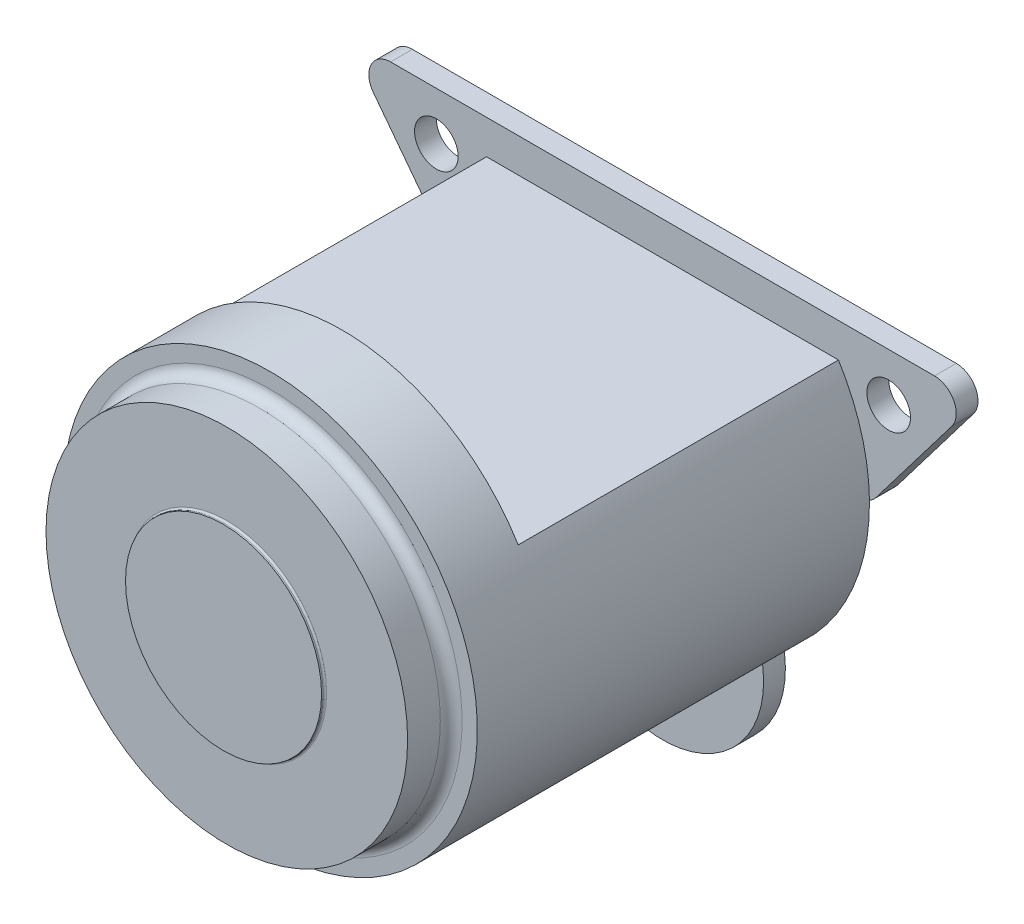
ISO-10303-21;
HEADER;
FILE_DESCRIPTION(('STEP AP214'),'2;1');
FILE_NAME('part.step','',(''),(''),'','','');
FILE_SCHEMA(('AUTOMOTIVE_DESIGN { 1 0 10303 214 1 1 1 1 }'));
ENDSEC;
DATA;
#1=APPLICATION_CONTEXT('core data for automotive mechanical design processes');
#2=APPLICATION_PROTOCOL_DEFINITION('international standard','automotive_design',2000,#1);
#3=PRODUCT_CONTEXT('',#1,'mechanical');
#4=PRODUCT('Part','Part','',(#3));
#5=PRODUCT_RELATED_PRODUCT_CATEGORY('part','',(#4));
#6=PRODUCT_DEFINITION_FORMATION('','',#4);
#7=PRODUCT_DEFINITION_CONTEXT('part definition',#1,'design');
#8=PRODUCT_DEFINITION('design','',#6,#7);
#9=PRODUCT_DEFINITION_SHAPE('','',#8);
#10=(LENGTH_UNIT() NAMED_UNIT(*) SI_UNIT(.MILLI.,.METRE.));
#11=(NAMED_UNIT(*) PLANE_ANGLE_UNIT() SI_UNIT($,.RADIAN.));
#12=(NAMED_UNIT(*) SI_UNIT($,.STERADIAN.) SOLID_ANGLE_UNIT());
#13=UNCERTAINTY_MEASURE_WITH_UNIT(LENGTH_MEASURE(1.E-05),#10,'distance_accuracy_value','');
#14=(GEOMETRIC_REPRESENTATION_CONTEXT(3) GLOBAL_UNCERTAINTY_ASSIGNED_CONTEXT((#13)) GLOBAL_UNIT_ASSIGNED_CONTEXT((#10,
#11,#12)) REPRESENTATION_CONTEXT('',''));
#15=CARTESIAN_POINT('',(0.,0.,0.));
#16=DIRECTION('',(0.,0.,1.));
#17=DIRECTION('',(1.,0.,0.));
#18=AXIS2_PLACEMENT_3D('',#15,#16,#17);
#19=CARTESIAN_POINT('',(0.,0.,0.));
#20=DIRECTION('',(0.,0.,1.));
#21=DIRECTION('',(1.,0.,0.));
#22=AXIS2_PLACEMENT_3D('',#19,#20,#21);
#23=CYLINDRICAL_SURFACE('',#22,95.);
#24=CARTESIAN_POINT('',(0.,0.,180.));
#25=DIRECTION('',(0.,0.,-1.));
#26=DIRECTION('',(1.,0.,0.));
#27=AXIS2_PLACEMENT_3D('',#24,#25,#26);
#28=CIRCLE('',#27,95.);
#29=CARTESIAN_POINT('',(-95.,0.,180.));
#30=VERTEX_POINT('',#29);
#31=EDGE_CURVE('E254',#30,#30,#28,.T.);
#32=ORIENTED_EDGE('',*,*,#31,.T.);
#33=DIRECTION('',(0.,0.,-1.));
#34=VECTOR('',#33,1.);
#35=CARTESIAN_POINT('',(-95.,0.,0.));
#36=LINE('',#35,#34);
#37=CARTESIAN_POINT('',(-95.,0.,0.));
#38=VERTEX_POINT('',#37);
#39=EDGE_CURVE('E11',#30,#38,#36,.T.);
#40=ORIENTED_EDGE('',*,*,#39,.T.);
#41=CARTESIAN_POINT('',(0.,0.,0.));
#42=DIRECTION('',(0.,0.,1.));
#43=DIRECTION('',(1.,0.,0.));
#44=AXIS2_PLACEMENT_3D('',#41,#42,#43);
#45=CIRCLE('',#44,95.);
#46=CARTESIAN_POINT('',(-45.,-83.6660026534075,0.));
#47=VERTEX_POINT('',#46);
#48=EDGE_CURVE('E406',#38,#47,#45,.T.);
#49=ORIENTED_EDGE('',*,*,#48,.T.);
#50=CARTESIAN_POINT('',(0.,0.,0.));
#51=DIRECTION('',(0.,0.,1.));
#52=DIRECTION('',(1.,0.,0.));
#53=AXIS2_PLACEMENT_3D('',#50,#51,#52);
#54=CIRCLE('',#53,95.);
#55=CARTESIAN_POINT('',(45.,-83.6660026534075,0.));
#56=VERTEX_POINT('',#55);
#57=EDGE_CURVE('E359',#47,#56,#54,.T.);
#58=ORIENTED_EDGE('',*,*,#57,.T.);
#59=CARTESIAN_POINT('',(0.,0.,0.));
#60=DIRECTION('',(0.,0.,1.));
#61=DIRECTION('',(1.,0.,0.));
#62=AXIS2_PLACEMENT_3D('',#59,#60,#61);
#63=CIRCLE('',#62,95.);
#64=CARTESIAN_POINT('',(94.9909756892941,1.30940352677538,0.));
#65=VERTEX_POINT('',#64);
#66=EDGE_CURVE('E300',#56,#65,#63,.T.);
#67=ORIENTED_EDGE('',*,*,#66,.T.);
#68=CARTESIAN_POINT('',(0.,0.,0.));
#69=DIRECTION('',(0.,0.,1.));
#70=DIRECTION('',(1.,0.,0.));
#71=AXIS2_PLACEMENT_3D('',#68,#69,#70);
#72=CIRCLE('',#71,95.);
#73=CARTESIAN_POINT('',(80.7774721070176,50.,0.));
#74=VERTEX_POINT('',#73);
#75=EDGE_CURVE('E336',#65,#74,#72,.T.);
#76=ORIENTED_EDGE('',*,*,#75,.T.);
#77=DIRECTION('',(0.,0.,1.));
#78=VECTOR('',#77,1.);
#79=CARTESIAN_POINT('',(80.7774721070176,50.,0.));
#80=LINE('',#79,#78);
#81=CARTESIAN_POINT('',(80.7774721070176,50.,147.));
#82=VERTEX_POINT('',#81);
#83=EDGE_CURVE('E409',#74,#82,#80,.T.);
#84=ORIENTED_EDGE('',*,*,#83,.T.);
#85=CARTESIAN_POINT('',(0.,0.,147.));
#86=DIRECTION('',(0.,0.,1.));
#87=DIRECTION('',(1.,0.,0.));
#88=AXIS2_PLACEMENT_3D('',#85,#86,#87);
#89=CIRCLE('',#88,95.);
#90=CARTESIAN_POINT('',(-80.7774721070175,50.,147.));
#91=VERTEX_POINT('',#90);
#92=EDGE_CURVE('E273',#82,#91,#89,.T.);
#93=ORIENTED_EDGE('',*,*,#92,.T.);
#94=DIRECTION('',(0.,0.,-1.));
#95=VECTOR('',#94,1.);
#96=CARTESIAN_POINT('',(-80.7774721070176,50.,0.));
#97=LINE('',#96,#95);
#98=CARTESIAN_POINT('',(-80.7774721070175,50.,0.));
#99=VERTEX_POINT('',#98);
#100=EDGE_CURVE('E358',#91,#99,#97,.T.);
#101=ORIENTED_EDGE('',*,*,#100,.T.);
#102=CARTESIAN_POINT('',(0.,0.,0.));
#103=DIRECTION('',(0.,0.,1.));
#104=DIRECTION('',(1.,0.,0.));
#105=AXIS2_PLACEMENT_3D('',#102,#103,#104);
#106=CIRCLE('',#105,95.);
#107=CARTESIAN_POINT('',(-94.9909756892941,1.30940352677539,0.));
#108=VERTEX_POINT('',#107);
#109=EDGE_CURVE('E325',#99,#108,#106,.T.);
#110=ORIENTED_EDGE('',*,*,#109,.T.);
#111=CARTESIAN_POINT('',(0.,0.,0.));
#112=DIRECTION('',(0.,0.,1.));
#113=DIRECTION('',(1.,0.,0.));
#114=AXIS2_PLACEMENT_3D('',#111,#112,#113);
#115=CIRCLE('',#114,95.);
#116=EDGE_CURVE('E413',#108,#38,#115,.T.);
#117=ORIENTED_EDGE('',*,*,#116,.T.);
#118=ORIENTED_EDGE('',*,*,#39,.F.);
#119=EDGE_LOOP('',(#32,#40,#49,#58,#67,#76,#84,#93,#101,#110,#117,#118));
#120=FACE_BOUND('',#119,.T.);
#121=ADVANCED_FACE('F16',(#120),#23,.T.);
#122=CARTESIAN_POINT('',(0.,0.,201.5));
#123=DIRECTION('',(0.,0.,1.));
#124=DIRECTION('',(1.,0.,0.));
#125=AXIS2_PLACEMENT_3D('',#122,#123,#124);
#126=PLANE('',#125);
#127=CARTESIAN_POINT('',(0.,0.,201.5));
#128=DIRECTION('',(0.,0.,1.));
#129=DIRECTION('',(1.,0.,0.));
#130=AXIS2_PLACEMENT_3D('',#127,#128,#129);
#131=CIRCLE('',#130,45.);
#132=CARTESIAN_POINT('',(-45.,0.,201.5));
#133=VERTEX_POINT('',#132);
#134=EDGE_CURVE('E434',#133,#133,#131,.T.);
#135=ORIENTED_EDGE('',*,*,#134,.T.);
#136=EDGE_LOOP('',(#135));
#137=FACE_BOUND('',#136,.T.);
#138=ADVANCED_FACE('F448',(#137),#126,.T.);
#139=CARTESIAN_POINT('',(0.,0.,200.));
#140=DIRECTION('',(0.,0.,1.));
#141=DIRECTION('',(1.,0.,0.));
#142=AXIS2_PLACEMENT_3D('',#139,#140,#141);
#143=PLANE('',#142);
#144=CARTESIAN_POINT('',(0.,0.,200.));
#145=DIRECTION('',(0.,0.,1.));
#146=DIRECTION('',(-1.,0.,0.));
#147=AXIS2_PLACEMENT_3D('',#144,#145,#146);
#148=CIRCLE('',#147,45.8);
#149=CARTESIAN_POINT('',(45.8,0.,200.));
#150=VERTEX_POINT('',#149);
#151=EDGE_CURVE('E45',#150,#150,#148,.T.);
#152=ORIENTED_EDGE('',*,*,#151,.F.);
#153=EDGE_LOOP('',(#152));
#154=FACE_BOUND('',#153,.T.);
#155=CARTESIAN_POINT('',(0.,0.,200.));
#156=DIRECTION('',(0.,0.,1.));
#157=DIRECTION('',(-1.,0.,0.));
#158=AXIS2_PLACEMENT_3D('',#155,#156,#157);
#159=CIRCLE('',#158,83.);
#160=CARTESIAN_POINT('',(83.,0.,200.));
#161=VERTEX_POINT('',#160);
#162=EDGE_CURVE('E235',#161,#161,#159,.T.);
#163=ORIENTED_EDGE('',*,*,#162,.T.);
#164=EDGE_LOOP('',(#163));
#165=FACE_BOUND('',#164,.T.);
#166=ADVANCED_FACE('F463',(#154,#165),#143,.T.);
#167=CARTESIAN_POINT('',(0.,0.,200.));
#168=DIRECTION('',(0.,0.,1.));
#169=DIRECTION('',(1.,0.,0.));
#170=AXIS2_PLACEMENT_3D('',#167,#168,#169);
#171=CYLINDRICAL_SURFACE('',#170,45.);
#172=ORIENTED_EDGE('',*,*,#134,.F.);
#173=DIRECTION('',(0.,0.,-1.));
#174=VECTOR('',#173,1.);
#175=CARTESIAN_POINT('',(-45.,0.,200.));
#176=LINE('',#175,#174);
#177=CARTESIAN_POINT('',(-45.,0.,200.8));
#178=VERTEX_POINT('',#177);
#179=EDGE_CURVE('E24',#133,#178,#176,.T.);
#180=ORIENTED_EDGE('',*,*,#179,.T.);
#181=CARTESIAN_POINT('',(0.,0.,200.8));
#182=DIRECTION('',(0.,0.,-1.));
#183=DIRECTION('',(-1.,0.,0.));
#184=AXIS2_PLACEMENT_3D('',#181,#182,#183);
#185=CIRCLE('',#184,45.);
#186=CARTESIAN_POINT('',(45.,0.,200.8));
#187=VERTEX_POINT('',#186);
#188=EDGE_CURVE('E268',#187,#178,#185,.T.);
#189=ORIENTED_EDGE('',*,*,#188,.F.);
#190=CARTESIAN_POINT('',(0.,0.,200.8));
#191=DIRECTION('',(0.,0.,-1.));
#192=DIRECTION('',(-1.,0.,0.));
#193=AXIS2_PLACEMENT_3D('',#190,#191,#192);
#194=CIRCLE('',#193,45.);
#195=EDGE_CURVE('E272',#178,#187,#194,.T.);
#196=ORIENTED_EDGE('',*,*,#195,.F.);
#197=ORIENTED_EDGE('',*,*,#179,.F.);
#198=EDGE_LOOP('',(#172,#180,#189,#196,#197));
#199=FACE_BOUND('',#198,.T.);
#200=ADVANCED_FACE('F449',(#199),#171,.T.);
#201=CARTESIAN_POINT('',(0.,0.,200.8));
#202=DIRECTION('',(0.,0.,-1.));
#203=DIRECTION('',(-1.,0.,0.));
#204=AXIS2_PLACEMENT_3D('',#201,#202,#203);
#205=TOROIDAL_SURFACE('',#204,45.8,0.8);
#206=ORIENTED_EDGE('',*,*,#188,.T.);
#207=ORIENTED_EDGE('',*,*,#195,.T.);
#208=CARTESIAN_POINT('',(45.8,0.,200.8));
#209=DIRECTION('',(0.,-1.,0.));
#210=DIRECTION('',(1.,0.,0.));
#211=AXIS2_PLACEMENT_3D('',#208,#209,#210);
#212=CIRCLE('',#211,0.8);
#213=EDGE_CURVE('E441',#187,#150,#212,.T.);
#214=ORIENTED_EDGE('',*,*,#213,.T.);
#215=ORIENTED_EDGE('',*,*,#151,.T.);
#216=ORIENTED_EDGE('',*,*,#213,.F.);
#217=EDGE_LOOP('',(#206,#207,#214,#215,#216));
#218=FACE_BOUND('',#217,.T.);
#219=ADVANCED_FACE('F451',(#218),#205,.F.);
#220=CARTESIAN_POINT('',(0.,72.5,147.));
#221=DIRECTION('',(0.,0.,-1.));
#222=DIRECTION('',(0.,-1.,0.));
#223=AXIS2_PLACEMENT_3D('',#220,#221,#222);
#224=PLANE('',#223);
#225=ORIENTED_EDGE('',*,*,#92,.F.);
#226=DIRECTION('',(1.,0.,0.));
#227=VECTOR('',#226,1.);
#228=CARTESIAN_POINT('',(80.7774721070176,50.,147.));
#229=LINE('',#228,#227);
#230=EDGE_CURVE('E428',#91,#82,#229,.T.);
#231=ORIENTED_EDGE('',*,*,#230,.F.);
#232=EDGE_LOOP('',(#225,#231));
#233=FACE_BOUND('',#232,.T.);
#234=ADVANCED_FACE('F453',(#233),#224,.T.);
#235=CARTESIAN_POINT('',(-80.7774721070175,50.,0.));
#236=DIRECTION('',(0.,-1.,0.));
#237=DIRECTION('',(-1.,0.,0.));
#238=AXIS2_PLACEMENT_3D('',#235,#236,#237);
#239=PLANE('',#238);
#240=DIRECTION('',(1.,0.,0.));
#241=VECTOR('',#240,1.);
#242=CARTESIAN_POINT('',(-40.3887360535088,50.,0.));
#243=LINE('',#242,#241);
#244=EDGE_CURVE('E332',#99,#74,#243,.T.);
#245=ORIENTED_EDGE('',*,*,#244,.F.);
#246=ORIENTED_EDGE('',*,*,#100,.F.);
#247=ORIENTED_EDGE('',*,*,#230,.T.);
#248=ORIENTED_EDGE('',*,*,#83,.F.);
#249=EDGE_LOOP('',(#245,#246,#247,#248));
#250=FACE_BOUND('',#249,.T.);
#251=ADVANCED_FACE('F460',(#250),#239,.F.);
#252=CARTESIAN_POINT('',(0.,32.849205670201,-10.));
#253=DIRECTION('',(0.,0.,-1.));
#254=DIRECTION('',(0.,-1.,0.));
#255=AXIS2_PLACEMENT_3D('',#252,#253,#254);
#256=PLANE('',#255);
#257=CARTESIAN_POINT('',(103.822834314861,43.5946178137431,-10.));
#258=DIRECTION('',(0.,0.,1.));
#259=DIRECTION('',(1.,0.,0.));
#260=AXIS2_PLACEMENT_3D('',#257,#258,#259);
#261=CIRCLE('',#260,10.);
#262=CARTESIAN_POINT('',(93.8228343148606,43.5946178137431,-10.));
#263=VERTEX_POINT('',#262);
#264=EDGE_CURVE('E295',#263,#263,#261,.T.);
#265=ORIENTED_EDGE('',*,*,#264,.T.);
#266=EDGE_LOOP('',(#265));
#267=FACE_BOUND('',#266,.T.);
#268=CARTESIAN_POINT('',(-103.822834314861,43.5946178137431,-10.));
#269=DIRECTION('',(0.,0.,1.));
#270=DIRECTION('',(1.,0.,0.));
#271=AXIS2_PLACEMENT_3D('',#268,#269,#270);
#272=CIRCLE('',#271,10.);
#273=CARTESIAN_POINT('',(-113.822834314861,43.5946178137431,-10.));
#274=VERTEX_POINT('',#273);
#275=EDGE_CURVE('E228',#274,#274,#272,.T.);
#276=ORIENTED_EDGE('',*,*,#275,.T.);
#277=EDGE_LOOP('',(#276));
#278=FACE_BOUND('',#277,.T.);
#279=CARTESIAN_POINT('',(-90.0439025202806,10.,-10.));
#280=DIRECTION('',(0.,0.,1.));
#281=DIRECTION('',(-0.444063912008529,-0.895995112738726,0.));
#282=AXIS2_PLACEMENT_3D('',#279,#280,#281);
#283=CIRCLE('',#282,10.);
#284=CARTESIAN_POINT('',(-98.0014844183462,3.94385515896637,-10.));
#285=VERTEX_POINT('',#284);
#286=CARTESIAN_POINT('',(-90.0439025202806,0.,-10.));
#287=VERTEX_POINT('',#286);
#288=EDGE_CURVE('E302',#285,#287,#283,.T.);
#289=ORIENTED_EDGE('',*,*,#288,.F.);
#290=DIRECTION('',(-0.605614484103363,0.795758189806563,0.));
#291=VECTOR('',#290,1.);
#292=CARTESIAN_POINT('',(-95.,0.,-10.));
#293=LINE('',#292,#291);
#294=CARTESIAN_POINT('',(-132.780416212926,49.6422664993684,-10.));
#295=VERTEX_POINT('',#294);
#296=EDGE_CURVE('E321',#285,#295,#293,.T.);
#297=ORIENTED_EDGE('',*,*,#296,.T.);
#298=CARTESIAN_POINT('',(-124.822834314861,55.6984113404021,-10.));
#299=DIRECTION('',(0.,0.,1.));
#300=DIRECTION('',(-0.895995112738726,0.444063912008529,0.));
#301=AXIS2_PLACEMENT_3D('',#298,#299,#300);
#302=CIRCLE('',#301,10.);
#303=CARTESIAN_POINT('',(-124.822834314861,65.6984113404021,-10.));
#304=VERTEX_POINT('',#303);
#305=EDGE_CURVE('E230',#304,#295,#302,.T.);
#306=ORIENTED_EDGE('',*,*,#305,.F.);
#307=DIRECTION('',(1.,0.,0.));
#308=VECTOR('',#307,1.);
#309=CARTESIAN_POINT('',(-145.,65.6984113404021,-10.));
#310=LINE('',#309,#308);
#311=CARTESIAN_POINT('',(124.822834314861,65.6984113404021,-10.));
#312=VERTEX_POINT('',#311);
#313=EDGE_CURVE('E355',#304,#312,#310,.T.);
#314=ORIENTED_EDGE('',*,*,#313,.T.);
#315=CARTESIAN_POINT('',(124.822834314861,55.6984113404021,-10.));
#316=DIRECTION('',(0.,0.,1.));
#317=DIRECTION('',(0.895995112738726,0.444063912008529,0.));
#318=AXIS2_PLACEMENT_3D('',#315,#316,#317);
#319=CIRCLE('',#318,10.);
#320=CARTESIAN_POINT('',(132.780416212926,49.6422664993684,-10.));
#321=VERTEX_POINT('',#320);
#322=EDGE_CURVE('E328',#321,#312,#319,.T.);
#323=ORIENTED_EDGE('',*,*,#322,.F.);
#324=DIRECTION('',(-0.605614484103363,-0.795758189806563,0.));
#325=VECTOR('',#324,1.);
#326=CARTESIAN_POINT('',(145.,65.6984113404021,-10.));
#327=LINE('',#326,#325);
#328=CARTESIAN_POINT('',(98.0014844183462,3.94385515896637,-10.));
#329=VERTEX_POINT('',#328);
#330=EDGE_CURVE('E378',#321,#329,#327,.T.);
#331=ORIENTED_EDGE('',*,*,#330,.T.);
#332=CARTESIAN_POINT('',(90.0439025202806,10.,-10.));
#333=DIRECTION('',(0.,0.,1.));
#334=DIRECTION('',(0.444063912008529,-0.895995112738726,0.));
#335=AXIS2_PLACEMENT_3D('',#332,#333,#334);
#336=CIRCLE('',#335,10.);
#337=CARTESIAN_POINT('',(90.0439025202806,0.,-10.));
#338=VERTEX_POINT('',#337);
#339=EDGE_CURVE('E349',#338,#329,#336,.T.);
#340=ORIENTED_EDGE('',*,*,#339,.F.);
#341=DIRECTION('',(-1.,0.,0.));
#342=VECTOR('',#341,1.);
#343=CARTESIAN_POINT('',(95.,0.,-10.));
#344=LINE('',#343,#342);
#345=EDGE_CURVE('E391',#338,#287,#344,.T.);
#346=ORIENTED_EDGE('',*,*,#345,.T.);
#347=EDGE_LOOP('',(#289,#297,#306,#314,#323,#331,#340,#346));
#348=FACE_BOUND('',#347,.T.);
#349=ADVANCED_FACE('F545',(#267,#278,#348),#256,.T.);
#350=CARTESIAN_POINT('',(-145.,65.6984113404021,0.));
#351=DIRECTION('',(0.,1.,0.));
#352=DIRECTION('',(1.,0.,0.));
#353=AXIS2_PLACEMENT_3D('',#350,#351,#352);
#354=PLANE('',#353);
#355=DIRECTION('',(0.,0.,1.));
#356=VECTOR('',#355,1.);
#357=CARTESIAN_POINT('',(124.822834314861,65.6984113404021,0.));
#358=LINE('',#357,#356);
#359=CARTESIAN_POINT('',(124.822834314861,65.6984113404021,0.));
#360=VERTEX_POINT('',#359);
#361=EDGE_CURVE('E234',#312,#360,#358,.T.);
#362=ORIENTED_EDGE('',*,*,#361,.F.);
#363=ORIENTED_EDGE('',*,*,#313,.F.);
#364=DIRECTION('',(0.,0.,-1.));
#365=VECTOR('',#364,1.);
#366=CARTESIAN_POINT('',(-124.822834314861,65.6984113404021,0.));
#367=LINE('',#366,#365);
#368=CARTESIAN_POINT('',(-124.822834314861,65.6984113404021,0.));
#369=VERTEX_POINT('',#368);
#370=EDGE_CURVE('E233',#369,#304,#367,.T.);
#371=ORIENTED_EDGE('',*,*,#370,.F.);
#372=DIRECTION('',(1.,0.,0.));
#373=VECTOR('',#372,1.);
#374=CARTESIAN_POINT('',(-145.,65.6984113404021,0.));
#375=LINE('',#374,#373);
#376=EDGE_CURVE('E350',#369,#360,#375,.T.);
#377=ORIENTED_EDGE('',*,*,#376,.T.);
#378=EDGE_LOOP('',(#362,#363,#371,#377));
#379=FACE_BOUND('',#378,.T.);
#380=ADVANCED_FACE('F541',(#379),#354,.T.);
#381=CARTESIAN_POINT('',(0.,-112.535692419832,0.));
#382=DIRECTION('',(0.,0.,-1.));
#383=DIRECTION('',(0.,-1.,0.));
#384=AXIS2_PLACEMENT_3D('',#381,#382,#383);
#385=PLANE('',#384);
#386=CARTESIAN_POINT('',(0.,-116.405382186257,0.));
#387=DIRECTION('',(0.,0.,-1.));
#388=DIRECTION('',(1.,0.,0.));
#389=AXIS2_PLACEMENT_3D('',#386,#387,#388);
#390=CIRCLE('',#389,10.);
#391=CARTESIAN_POINT('',(-10.,-116.405382186257,0.));
#392=VERTEX_POINT('',#391);
#393=EDGE_CURVE('E267',#392,#392,#390,.T.);
#394=ORIENTED_EDGE('',*,*,#393,.T.);
#395=EDGE_LOOP('',(#394));
#396=FACE_BOUND('',#395,.T.);
#397=ORIENTED_EDGE('',*,*,#57,.F.);
#398=CARTESIAN_POINT('',(0.,-95.,0.));
#399=DIRECTION('',(0.,0.,-1.));
#400=DIRECTION('',(0.96971510372189,0.244238853611878,0.));
#401=AXIS2_PLACEMENT_3D('',#398,#399,#400);
#402=CIRCLE('',#401,46.4053821862569);
#403=EDGE_CURVE('E417',#56,#47,#402,.T.);
#404=ORIENTED_EDGE('',*,*,#403,.F.);
#405=EDGE_LOOP('',(#397,#404));
#406=FACE_BOUND('',#405,.T.);
#407=ADVANCED_FACE('F537',(#396,#406),#385,.F.);
#408=CARTESIAN_POINT('',(0.,-112.535692419832,-10.));
#409=DIRECTION('',(0.,0.,-1.));
#410=DIRECTION('',(0.,-1.,0.));
#411=AXIS2_PLACEMENT_3D('',#408,#409,#410);
#412=PLANE('',#411);
#413=CARTESIAN_POINT('',(0.,-116.405382186257,-10.));
#414=DIRECTION('',(0.,0.,1.));
#415=DIRECTION('',(1.,0.,0.));
#416=AXIS2_PLACEMENT_3D('',#413,#414,#415);
#417=CIRCLE('',#416,10.);
#418=CARTESIAN_POINT('',(-10.,-116.405382186257,-10.));
#419=VERTEX_POINT('',#418);
#420=EDGE_CURVE('E251',#419,#419,#417,.T.);
#421=ORIENTED_EDGE('',*,*,#420,.T.);
#422=EDGE_LOOP('',(#421));
#423=FACE_BOUND('',#422,.T.);
#424=CARTESIAN_POINT('',(0.,-95.,-10.));
#425=DIRECTION('',(0.,0.,-1.));
#426=DIRECTION('',(0.96971510372189,0.244238853611878,0.));
#427=AXIS2_PLACEMENT_3D('',#424,#425,#426);
#428=CIRCLE('',#427,46.4053821862569);
#429=CARTESIAN_POINT('',(45.,-83.6660026534075,-10.));
#430=VERTEX_POINT('',#429);
#431=CARTESIAN_POINT('',(-45.,-83.6660026534075,-10.));
#432=VERTEX_POINT('',#431);
#433=EDGE_CURVE('E421',#430,#432,#428,.T.);
#434=ORIENTED_EDGE('',*,*,#433,.T.);
#435=CARTESIAN_POINT('',(0.,-94.9984350930914,-10.));
#436=DIRECTION('',(0.,0.,-1.));
#437=DIRECTION('',(-0.969723090184247,0.244207142326989,0.));
#438=AXIS2_PLACEMENT_3D('',#435,#436,#437);
#439=CIRCLE('',#438,46.405);
#440=EDGE_CURVE('E301',#432,#430,#439,.T.);
#441=ORIENTED_EDGE('',*,*,#440,.T.);
#442=EDGE_LOOP('',(#434,#441));
#443=FACE_BOUND('',#442,.T.);
#444=ADVANCED_FACE('F533',(#423,#443),#412,.T.);
#445=CARTESIAN_POINT('',(0.,-95.,0.));
#446=DIRECTION('',(0.,0.,-1.));
#447=DIRECTION('',(0.,-1.,0.));
#448=AXIS2_PLACEMENT_3D('',#445,#446,#447);
#449=CYLINDRICAL_SURFACE('',#448,46.4053821862569);
#450=ORIENTED_EDGE('',*,*,#403,.T.);
#451=DIRECTION('',(0.,0.,-1.));
#452=VECTOR('',#451,1.);
#453=CARTESIAN_POINT('',(-45.,-83.6660026534075,0.));
#454=LINE('',#453,#452);
#455=EDGE_CURVE('E296',#47,#432,#454,.T.);
#456=ORIENTED_EDGE('',*,*,#455,.T.);
#457=ORIENTED_EDGE('',*,*,#433,.F.);
#458=DIRECTION('',(0.,0.,-1.));
#459=VECTOR('',#458,1.);
#460=CARTESIAN_POINT('',(45.,-83.6660026534075,0.));
#461=LINE('',#460,#459);
#462=EDGE_CURVE('E366',#56,#430,#461,.T.);
#463=ORIENTED_EDGE('',*,*,#462,.F.);
#464=EDGE_LOOP('',(#450,#456,#457,#463));
#465=FACE_BOUND('',#464,.T.);
#466=ADVANCED_FACE('F498',(#465),#449,.T.);
#467=CARTESIAN_POINT('',(0.,0.,0.));
#468=DIRECTION('',(0.,0.,1.));
#469=DIRECTION('',(1.,0.,0.));
#470=AXIS2_PLACEMENT_3D('',#467,#468,#469);
#471=PLANE('',#470);
#472=DIRECTION('',(1.,0.,0.));
#473=VECTOR('',#472,1.);
#474=CARTESIAN_POINT('',(47.5,0.,0.));
#475=LINE('',#474,#473);
#476=CARTESIAN_POINT('',(-90.0439025202806,0.,0.));
#477=VERTEX_POINT('',#476);
#478=CARTESIAN_POINT('',(90.0439025202806,0.,0.));
#479=VERTEX_POINT('',#478);
#480=EDGE_CURVE('E394',#477,#479,#475,.T.);
#481=ORIENTED_EDGE('',*,*,#480,.T.);
#482=CARTESIAN_POINT('',(90.0439025202806,10.,0.));
#483=DIRECTION('',(0.,0.,1.));
#484=DIRECTION('',(0.444063912008529,-0.895995112738726,0.));
#485=AXIS2_PLACEMENT_3D('',#482,#483,#484);
#486=CIRCLE('',#485,10.);
#487=EDGE_CURVE('E240',#479,#65,#486,.T.);
#488=ORIENTED_EDGE('',*,*,#487,.T.);
#489=ORIENTED_EDGE('',*,*,#66,.F.);
#490=CARTESIAN_POINT('',(0.,-94.9984350930914,0.));
#491=DIRECTION('',(0.,0.,1.));
#492=DIRECTION('',(-0.969723090184247,0.244207142326989,0.));
#493=AXIS2_PLACEMENT_3D('',#490,#491,#492);
#494=CIRCLE('',#493,46.405);
#495=EDGE_CURVE('E397',#56,#47,#494,.T.);
#496=ORIENTED_EDGE('',*,*,#495,.T.);
#497=ORIENTED_EDGE('',*,*,#48,.F.);
#498=ORIENTED_EDGE('',*,*,#116,.F.);
#499=CARTESIAN_POINT('',(-90.0439025202806,10.,0.));
#500=DIRECTION('',(0.,0.,-1.));
#501=DIRECTION('',(-0.444063912008529,-0.895995112738726,0.));
#502=AXIS2_PLACEMENT_3D('',#499,#500,#501);
#503=CIRCLE('',#502,10.);
#504=EDGE_CURVE('E284',#477,#108,#503,.T.);
#505=ORIENTED_EDGE('',*,*,#504,.F.);
#506=EDGE_LOOP('',(#481,#488,#489,#496,#497,#498,#505));
#507=FACE_BOUND('',#506,.T.);
#508=ADVANCED_FACE('F494',(#507),#471,.F.);
#509=CARTESIAN_POINT('',(0.,-94.9984350930914,0.));
#510=DIRECTION('',(0.,0.,-1.));
#511=DIRECTION('',(-0.969723090184247,0.244207142326989,0.));
#512=AXIS2_PLACEMENT_3D('',#509,#510,#511);
#513=CYLINDRICAL_SURFACE('',#512,46.405);
#514=ORIENTED_EDGE('',*,*,#495,.F.);
#515=ORIENTED_EDGE('',*,*,#462,.T.);
#516=ORIENTED_EDGE('',*,*,#440,.F.);
#517=ORIENTED_EDGE('',*,*,#455,.F.);
#518=EDGE_LOOP('',(#514,#515,#516,#517));
#519=FACE_BOUND('',#518,.T.);
#520=ADVANCED_FACE('F497',(#519),#513,.T.);
#521=CARTESIAN_POINT('',(95.,0.,0.));
#522=DIRECTION('',(0.,-1.,0.));
#523=DIRECTION('',(0.,0.,-1.));
#524=AXIS2_PLACEMENT_3D('',#521,#522,#523);
#525=PLANE('',#524);
#526=DIRECTION('',(0.,0.,1.));
#527=VECTOR('',#526,1.);
#528=CARTESIAN_POINT('',(-90.0439025202806,0.,0.));
#529=LINE('',#528,#527);
#530=EDGE_CURVE('E306',#287,#477,#529,.T.);
#531=ORIENTED_EDGE('',*,*,#530,.F.);
#532=ORIENTED_EDGE('',*,*,#345,.F.);
#533=DIRECTION('',(0.,0.,-1.));
#534=VECTOR('',#533,1.);
#535=CARTESIAN_POINT('',(90.0439025202806,0.,0.));
#536=LINE('',#535,#534);
#537=EDGE_CURVE('E244',#479,#338,#536,.T.);
#538=ORIENTED_EDGE('',*,*,#537,.F.);
#539=ORIENTED_EDGE('',*,*,#480,.F.);
#540=EDGE_LOOP('',(#531,#532,#538,#539));
#541=FACE_BOUND('',#540,.T.);
#542=ADVANCED_FACE('F520',(#541),#525,.T.);
#543=CARTESIAN_POINT('',(-124.822834314861,55.6984113404021,0.));
#544=DIRECTION('',(0.,0.,-1.));
#545=DIRECTION('',(-0.895995112738726,0.444063912008529,0.));
#546=AXIS2_PLACEMENT_3D('',#543,#544,#545);
#547=CYLINDRICAL_SURFACE('',#546,10.);
#548=ORIENTED_EDGE('',*,*,#305,.T.);
#549=DIRECTION('',(0.,0.,1.));
#550=VECTOR('',#549,1.);
#551=CARTESIAN_POINT('',(-132.780416212926,49.6422664993684,0.));
#552=LINE('',#551,#550);
#553=CARTESIAN_POINT('',(-132.780416212926,49.6422664993684,0.));
#554=VERTEX_POINT('',#553);
#555=EDGE_CURVE('E262',#295,#554,#552,.T.);
#556=ORIENTED_EDGE('',*,*,#555,.T.);
#557=CARTESIAN_POINT('',(-124.822834314861,55.6984113404021,0.));
#558=DIRECTION('',(0.,0.,-1.));
#559=DIRECTION('',(-0.895995112738726,0.444063912008529,0.));
#560=AXIS2_PLACEMENT_3D('',#557,#558,#559);
#561=CIRCLE('',#560,10.);
#562=EDGE_CURVE('E345',#554,#369,#561,.T.);
#563=ORIENTED_EDGE('',*,*,#562,.T.);
#564=ORIENTED_EDGE('',*,*,#370,.T.);
#565=EDGE_LOOP('',(#548,#556,#563,#564));
#566=FACE_BOUND('',#565,.T.);
#567=ADVANCED_FACE('F523',(#566),#547,.T.);
#568=CARTESIAN_POINT('',(124.822834314861,55.6984113404021,0.));
#569=DIRECTION('',(0.,0.,-1.));
#570=DIRECTION('',(0.895995112738726,0.444063912008529,0.));
#571=AXIS2_PLACEMENT_3D('',#568,#569,#570);
#572=CYLINDRICAL_SURFACE('',#571,10.);
#573=ORIENTED_EDGE('',*,*,#322,.T.);
#574=ORIENTED_EDGE('',*,*,#361,.T.);
#575=CARTESIAN_POINT('',(124.822834314861,55.6984113404021,0.));
#576=DIRECTION('',(0.,0.,-1.));
#577=DIRECTION('',(0.895995112738726,0.444063912008529,0.));
#578=AXIS2_PLACEMENT_3D('',#575,#576,#577);
#579=CIRCLE('',#578,10.);
#580=CARTESIAN_POINT('',(132.780416212926,49.6422664993684,0.));
#581=VERTEX_POINT('',#580);
#582=EDGE_CURVE('E354',#360,#581,#579,.T.);
#583=ORIENTED_EDGE('',*,*,#582,.T.);
#584=DIRECTION('',(0.,0.,-1.));
#585=VECTOR('',#584,1.);
#586=CARTESIAN_POINT('',(132.780416212926,49.6422664993684,0.));
#587=LINE('',#586,#585);
#588=EDGE_CURVE('E381',#581,#321,#587,.T.);
#589=ORIENTED_EDGE('',*,*,#588,.T.);
#590=EDGE_LOOP('',(#573,#574,#583,#589));
#591=FACE_BOUND('',#590,.T.);
#592=ADVANCED_FACE('F518',(#591),#572,.T.);
#593=CARTESIAN_POINT('',(145.,65.6984113404021,0.));
#594=DIRECTION('',(0.795758189806563,-0.605614484103363,0.));
#595=DIRECTION('',(0.,0.,-1.));
#596=AXIS2_PLACEMENT_3D('',#593,#594,#595);
#597=PLANE('',#596);
#598=DIRECTION('',(0.,0.,1.));
#599=VECTOR('',#598,1.);
#600=CARTESIAN_POINT('',(98.0014844183462,3.94385515896637,0.));
#601=LINE('',#600,#599);
#602=CARTESIAN_POINT('',(98.0014844183462,3.94385515896637,0.));
#603=VERTEX_POINT('',#602);
#604=EDGE_CURVE('E245',#329,#603,#601,.T.);
#605=ORIENTED_EDGE('',*,*,#604,.F.);
#606=ORIENTED_EDGE('',*,*,#330,.F.);
#607=ORIENTED_EDGE('',*,*,#588,.F.);
#608=DIRECTION('',(-0.605614484103363,-0.795758189806563,0.));
#609=VECTOR('',#608,1.);
#610=CARTESIAN_POINT('',(145.,65.6984113404021,0.));
#611=LINE('',#610,#609);
#612=EDGE_CURVE('E344',#581,#603,#611,.T.);
#613=ORIENTED_EDGE('',*,*,#612,.T.);
#614=EDGE_LOOP('',(#605,#606,#607,#613));
#615=FACE_BOUND('',#614,.T.);
#616=ADVANCED_FACE('F514',(#615),#597,.T.);
#617=CARTESIAN_POINT('',(90.0439025202806,10.,0.));
#618=DIRECTION('',(0.,0.,-1.));
#619=DIRECTION('',(0.444063912008529,-0.895995112738726,0.));
#620=AXIS2_PLACEMENT_3D('',#617,#618,#619);
#621=CYLINDRICAL_SURFACE('',#620,10.);
#622=ORIENTED_EDGE('',*,*,#339,.T.);
#623=ORIENTED_EDGE('',*,*,#604,.T.);
#624=CARTESIAN_POINT('',(90.0439025202806,10.,0.));
#625=DIRECTION('',(0.,0.,-1.));
#626=DIRECTION('',(0.444063912008529,-0.895995112738726,0.));
#627=AXIS2_PLACEMENT_3D('',#624,#625,#626);
#628=CIRCLE('',#627,10.);
#629=EDGE_CURVE('E340',#603,#65,#628,.T.);
#630=ORIENTED_EDGE('',*,*,#629,.T.);
#631=ORIENTED_EDGE('',*,*,#487,.F.);
#632=ORIENTED_EDGE('',*,*,#537,.T.);
#633=EDGE_LOOP('',(#622,#623,#630,#631,#632));
#634=FACE_BOUND('',#633,.T.);
#635=ADVANCED_FACE('F510',(#634),#621,.T.);
#636=CARTESIAN_POINT('',(0.,32.849205670201,0.));
#637=DIRECTION('',(0.,0.,-1.));
#638=DIRECTION('',(0.,-1.,0.));
#639=AXIS2_PLACEMENT_3D('',#636,#637,#638);
#640=PLANE('',#639);
#641=CARTESIAN_POINT('',(103.822834314861,43.5946178137431,0.));
#642=DIRECTION('',(0.,0.,-1.));
#643=DIRECTION('',(1.,0.,0.));
#644=AXIS2_PLACEMENT_3D('',#641,#642,#643);
#645=CIRCLE('',#644,10.);
#646=CARTESIAN_POINT('',(93.8228343148606,43.5946178137431,0.));
#647=VERTEX_POINT('',#646);
#648=EDGE_CURVE('E287',#647,#647,#645,.T.);
#649=ORIENTED_EDGE('',*,*,#648,.T.);
#650=EDGE_LOOP('',(#649));
#651=FACE_BOUND('',#650,.T.);
#652=CARTESIAN_POINT('',(-103.822834314861,43.5946178137431,0.));
#653=DIRECTION('',(0.,0.,-1.));
#654=DIRECTION('',(1.,0.,0.));
#655=AXIS2_PLACEMENT_3D('',#652,#653,#654);
#656=CIRCLE('',#655,10.);
#657=CARTESIAN_POINT('',(-113.822834314861,43.5946178137431,0.));
#658=VERTEX_POINT('',#657);
#659=EDGE_CURVE('E229',#658,#658,#656,.T.);
#660=ORIENTED_EDGE('',*,*,#659,.T.);
#661=EDGE_LOOP('',(#660));
#662=FACE_BOUND('',#661,.T.);
#663=CARTESIAN_POINT('',(-90.0439025202806,10.,0.));
#664=DIRECTION('',(0.,0.,-1.));
#665=DIRECTION('',(-0.444063912008529,-0.895995112738726,0.));
#666=AXIS2_PLACEMENT_3D('',#663,#664,#665);
#667=CIRCLE('',#666,10.);
#668=CARTESIAN_POINT('',(-98.0014844183462,3.94385515896637,0.));
#669=VERTEX_POINT('',#668);
#670=EDGE_CURVE('E280',#108,#669,#667,.T.);
#671=ORIENTED_EDGE('',*,*,#670,.F.);
#672=ORIENTED_EDGE('',*,*,#109,.F.);
#673=ORIENTED_EDGE('',*,*,#244,.T.);
#674=ORIENTED_EDGE('',*,*,#75,.F.);
#675=ORIENTED_EDGE('',*,*,#629,.F.);
#676=ORIENTED_EDGE('',*,*,#612,.F.);
#677=ORIENTED_EDGE('',*,*,#582,.F.);
#678=ORIENTED_EDGE('',*,*,#376,.F.);
#679=ORIENTED_EDGE('',*,*,#562,.F.);
#680=DIRECTION('',(-0.605614484103363,0.795758189806563,0.));
#681=VECTOR('',#680,1.);
#682=CARTESIAN_POINT('',(-95.,0.,0.));
#683=LINE('',#682,#681);
#684=EDGE_CURVE('E258',#669,#554,#683,.T.);
#685=ORIENTED_EDGE('',*,*,#684,.F.);
#686=EDGE_LOOP('',(#671,#672,#673,#674,#675,#676,#677,#678,#679,#685));
#687=FACE_BOUND('',#686,.T.);
#688=ADVANCED_FACE('F507',(#651,#662,#687),#640,.F.);
#689=CARTESIAN_POINT('',(-95.,0.,0.));
#690=DIRECTION('',(-0.795758189806563,-0.605614484103363,0.));
#691=DIRECTION('',(-0.605614484103363,0.795758189806563,0.));
#692=AXIS2_PLACEMENT_3D('',#689,#690,#691);
#693=PLANE('',#692);
#694=DIRECTION('',(0.,0.,-1.));
#695=VECTOR('',#694,1.);
#696=CARTESIAN_POINT('',(-98.0014844183462,3.94385515896637,0.));
#697=LINE('',#696,#695);
#698=EDGE_CURVE('E263',#669,#285,#697,.T.);
#699=ORIENTED_EDGE('',*,*,#698,.F.);
#700=ORIENTED_EDGE('',*,*,#684,.T.);
#701=ORIENTED_EDGE('',*,*,#555,.F.);
#702=ORIENTED_EDGE('',*,*,#296,.F.);
#703=EDGE_LOOP('',(#699,#700,#701,#702));
#704=FACE_BOUND('',#703,.T.);
#705=ADVANCED_FACE('F488',(#704),#693,.T.);
#706=CARTESIAN_POINT('',(-90.0439025202806,10.,0.));
#707=DIRECTION('',(0.,0.,-1.));
#708=DIRECTION('',(-0.444063912008529,-0.895995112738726,0.));
#709=AXIS2_PLACEMENT_3D('',#706,#707,#708);
#710=CYLINDRICAL_SURFACE('',#709,10.);
#711=ORIENTED_EDGE('',*,*,#288,.T.);
#712=ORIENTED_EDGE('',*,*,#530,.T.);
#713=ORIENTED_EDGE('',*,*,#504,.T.);
#714=ORIENTED_EDGE('',*,*,#670,.T.);
#715=ORIENTED_EDGE('',*,*,#698,.T.);
#716=EDGE_LOOP('',(#711,#712,#713,#714,#715));
#717=FACE_BOUND('',#716,.T.);
#718=ADVANCED_FACE('F502',(#717),#710,.T.);
#719=CARTESIAN_POINT('',(103.822834314861,43.5946178137431,0.));
#720=DIRECTION('',(0.,0.,-1.));
#721=DIRECTION('',(1.,0.,0.));
#722=AXIS2_PLACEMENT_3D('',#719,#720,#721);
#723=CYLINDRICAL_SURFACE('',#722,10.);
#724=ORIENTED_EDGE('',*,*,#648,.F.);
#725=DIRECTION('',(0.,0.,-1.));
#726=VECTOR('',#725,1.);
#727=CARTESIAN_POINT('',(93.8228343148606,43.5946178137431,0.));
#728=LINE('',#727,#726);
#729=EDGE_CURVE('E291',#647,#263,#728,.T.);
#730=ORIENTED_EDGE('',*,*,#729,.T.);
#731=ORIENTED_EDGE('',*,*,#264,.F.);
#732=ORIENTED_EDGE('',*,*,#729,.F.);
#733=EDGE_LOOP('',(#724,#730,#731,#732));
#734=FACE_BOUND('',#733,.T.);
#735=ADVANCED_FACE('F492',(#734),#723,.F.);
#736=CARTESIAN_POINT('',(-103.822834314861,43.5946178137431,0.));
#737=DIRECTION('',(0.,0.,-1.));
#738=DIRECTION('',(1.,0.,0.));
#739=AXIS2_PLACEMENT_3D('',#736,#737,#738);
#740=CYLINDRICAL_SURFACE('',#739,10.);
#741=ORIENTED_EDGE('',*,*,#659,.F.);
#742=DIRECTION('',(0.,0.,-1.));
#743=VECTOR('',#742,1.);
#744=CARTESIAN_POINT('',(-113.822834314861,43.5946178137431,0.));
#745=LINE('',#744,#743);
#746=EDGE_CURVE('E224',#658,#274,#745,.T.);
#747=ORIENTED_EDGE('',*,*,#746,.T.);
#748=ORIENTED_EDGE('',*,*,#275,.F.);
#749=ORIENTED_EDGE('',*,*,#746,.F.);
#750=EDGE_LOOP('',(#741,#747,#748,#749));
#751=FACE_BOUND('',#750,.T.);
#752=ADVANCED_FACE('F484',(#751),#740,.F.);
#753=CARTESIAN_POINT('',(0.,-116.405382186257,0.));
#754=DIRECTION('',(0.,0.,-1.));
#755=DIRECTION('',(1.,0.,0.));
#756=AXIS2_PLACEMENT_3D('',#753,#754,#755);
#757=CYLINDRICAL_SURFACE('',#756,10.);
#758=ORIENTED_EDGE('',*,*,#393,.F.);
#759=DIRECTION('',(0.,0.,-1.));
#760=VECTOR('',#759,1.);
#761=CARTESIAN_POINT('',(-10.,-116.405382186257,0.));
#762=LINE('',#761,#760);
#763=EDGE_CURVE('E257',#392,#419,#762,.T.);
#764=ORIENTED_EDGE('',*,*,#763,.T.);
#765=ORIENTED_EDGE('',*,*,#420,.F.);
#766=ORIENTED_EDGE('',*,*,#763,.F.);
#767=EDGE_LOOP('',(#758,#764,#765,#766));
#768=FACE_BOUND('',#767,.T.);
#769=ADVANCED_FACE('F475',(#768),#757,.F.);
#770=CARTESIAN_POINT('',(0.,0.,180.));
#771=DIRECTION('',(0.,0.,1.));
#772=DIRECTION('',(1.,0.,0.));
#773=AXIS2_PLACEMENT_3D('',#770,#771,#772);
#774=PLANE('',#773);
#775=CARTESIAN_POINT('',(0.,0.,180.));
#776=DIRECTION('',(0.,0.,1.));
#777=DIRECTION('',(-1.,0.,0.));
#778=AXIS2_PLACEMENT_3D('',#775,#776,#777);
#779=CIRCLE('',#778,88.);
#780=CARTESIAN_POINT('',(-88.,0.,180.));
#781=VERTEX_POINT('',#780);
#782=EDGE_CURVE('E209',#781,#781,#779,.T.);
#783=ORIENTED_EDGE('',*,*,#782,.F.);
#784=EDGE_LOOP('',(#783));
#785=FACE_BOUND('',#784,.T.);
#786=ORIENTED_EDGE('',*,*,#31,.F.);
#787=EDGE_LOOP('',(#786));
#788=FACE_BOUND('',#787,.T.);
#789=ADVANCED_FACE('F472',(#785,#788),#774,.T.);
#790=CARTESIAN_POINT('',(0.,0.,200.));
#791=DIRECTION('',(0.,0.,-1.));
#792=DIRECTION('',(-1.,0.,0.));
#793=AXIS2_PLACEMENT_3D('',#790,#791,#792);
#794=CYLINDRICAL_SURFACE('',#793,83.);
#795=ORIENTED_EDGE('',*,*,#162,.F.);
#796=DIRECTION('',(0.,0.,-1.));
#797=VECTOR('',#796,1.);
#798=CARTESIAN_POINT('',(83.,0.,200.));
#799=LINE('',#798,#797);
#800=CARTESIAN_POINT('',(83.,0.,185.));
#801=VERTEX_POINT('',#800);
#802=EDGE_CURVE('E238',#161,#801,#799,.T.);
#803=ORIENTED_EDGE('',*,*,#802,.T.);
#804=CARTESIAN_POINT('',(0.,0.,185.));
#805=DIRECTION('',(0.,0.,-1.));
#806=DIRECTION('',(-1.,0.,0.));
#807=AXIS2_PLACEMENT_3D('',#804,#805,#806);
#808=CIRCLE('',#807,83.);
#809=CARTESIAN_POINT('',(-83.,0.,185.));
#810=VERTEX_POINT('',#809);
#811=EDGE_CURVE('E215',#810,#801,#808,.T.);
#812=ORIENTED_EDGE('',*,*,#811,.F.);
#813=CARTESIAN_POINT('',(0.,0.,185.));
#814=DIRECTION('',(0.,0.,-1.));
#815=DIRECTION('',(-1.,0.,0.));
#816=AXIS2_PLACEMENT_3D('',#813,#814,#815);
#817=CIRCLE('',#816,83.);
#818=EDGE_CURVE('E212',#801,#810,#817,.T.);
#819=ORIENTED_EDGE('',*,*,#818,.F.);
#820=ORIENTED_EDGE('',*,*,#802,.F.);
#821=EDGE_LOOP('',(#795,#803,#812,#819,#820));
#822=FACE_BOUND('',#821,.T.);
#823=ADVANCED_FACE('F474',(#822),#794,.T.);
#824=CARTESIAN_POINT('',(0.,0.,185.));
#825=DIRECTION('',(0.,0.,1.));
#826=DIRECTION('',(1.,0.,0.));
#827=AXIS2_PLACEMENT_3D('',#824,#825,#826);
#828=TOROIDAL_SURFACE('',#827,88.,5.);
#829=ORIENTED_EDGE('',*,*,#782,.T.);
#830=CARTESIAN_POINT('',(-88.,0.,185.));
#831=DIRECTION('',(0.,-1.,0.));
#832=DIRECTION('',(-1.,0.,0.));
#833=AXIS2_PLACEMENT_3D('',#830,#831,#832);
#834=CIRCLE('',#833,5.);
#835=EDGE_CURVE('E206',#781,#810,#834,.T.);
#836=ORIENTED_EDGE('',*,*,#835,.T.);
#837=ORIENTED_EDGE('',*,*,#811,.T.);
#838=ORIENTED_EDGE('',*,*,#818,.T.);
#839=ORIENTED_EDGE('',*,*,#835,.F.);
#840=EDGE_LOOP('',(#829,#836,#837,#838,#839));
#841=FACE_BOUND('',#840,.T.);
#842=ADVANCED_FACE('F207',(#841),#828,.F.);
#843=CLOSED_SHELL('',(#121,#138,#166,#200,#219,#234,#251,#349,#380,#407,#444,#466,#508,#520,
#542,#567,#592,#616,#635,#688,#705,#718,#735,#752,#769,#789,#823,#842));
#844=MANIFOLD_SOLID_BREP('B1',#843);
#845=ADVANCED_BREP_SHAPE_REPRESENTATION('',(#18,#844),#14);
#846=SHAPE_DEFINITION_REPRESENTATION(#9,#845);
ENDSEC;
END-ISO-10303-21;
